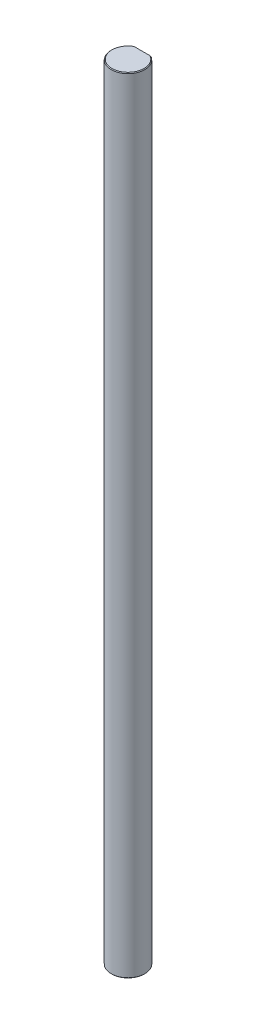
ISO-10303-21;
HEADER;
FILE_DESCRIPTION(('STEP AP214'),'2;1');
FILE_NAME('part.step','',(''),(''),'','','');
FILE_SCHEMA(('AUTOMOTIVE_DESIGN { 1 0 10303 214 1 1 1 1 }'));
ENDSEC;
DATA;
#1=APPLICATION_CONTEXT('core data for automotive mechanical design processes');
#2=APPLICATION_PROTOCOL_DEFINITION('international standard','automotive_design',2000,#1);
#3=PRODUCT_CONTEXT('',#1,'mechanical');
#4=PRODUCT('Part','Part','',(#3));
#5=PRODUCT_RELATED_PRODUCT_CATEGORY('part','',(#4));
#6=PRODUCT_DEFINITION_FORMATION('','',#4);
#7=PRODUCT_DEFINITION_CONTEXT('part definition',#1,'design');
#8=PRODUCT_DEFINITION('design','',#6,#7);
#9=PRODUCT_DEFINITION_SHAPE('','',#8);
#10=(LENGTH_UNIT() NAMED_UNIT(*) SI_UNIT(.MILLI.,.METRE.));
#11=(NAMED_UNIT(*) PLANE_ANGLE_UNIT() SI_UNIT($,.RADIAN.));
#12=(NAMED_UNIT(*) SI_UNIT($,.STERADIAN.) SOLID_ANGLE_UNIT());
#13=UNCERTAINTY_MEASURE_WITH_UNIT(LENGTH_MEASURE(1.E-05),#10,'distance_accuracy_value','');
#14=(GEOMETRIC_REPRESENTATION_CONTEXT(3) GLOBAL_UNCERTAINTY_ASSIGNED_CONTEXT((#13)) GLOBAL_UNIT_ASSIGNED_CONTEXT((#10,
#11,#12)) REPRESENTATION_CONTEXT('',''));
#15=CARTESIAN_POINT('',(0.,0.,0.));
#16=DIRECTION('',(0.,0.,1.));
#17=DIRECTION('',(1.,0.,0.));
#18=AXIS2_PLACEMENT_3D('',#15,#16,#17);
#19=CARTESIAN_POINT('',(0.,0.,0.));
#20=DIRECTION('',(0.,1.,0.));
#21=DIRECTION('',(0.,0.,1.));
#22=AXIS2_PLACEMENT_3D('',#19,#20,#21);
#23=PLANE('',#22);
#24=CARTESIAN_POINT('',(0.,5.6843418860808E-11,0.));
#25=DIRECTION('',(0.,1.,0.));
#26=DIRECTION('',(0.,0.,1.));
#27=AXIS2_PLACEMENT_3D('',#24,#25,#26);
#28=CIRCLE('',#27,2.87500000001728);
#29=CARTESIAN_POINT('',(-1.41972708646754,2.8421709430404E-11,-2.5));
#30=VERTEX_POINT('',#29);
#31=CARTESIAN_POINT('',(1.41972708646754,2.8421709430404E-11,-2.5));
#32=VERTEX_POINT('',#31);
#33=EDGE_CURVE('E19',#30,#32,#28,.T.);
#34=ORIENTED_EDGE('',*,*,#33,.F.);
#35=DIRECTION('',(-1.,0.,0.));
#36=VECTOR('',#35,1.);
#37=CARTESIAN_POINT('',(0.,0.,-2.5));
#38=LINE('',#37,#36);
#39=EDGE_CURVE('E58',#32,#30,#38,.T.);
#40=ORIENTED_EDGE('',*,*,#39,.F.);
#41=EDGE_LOOP('',(#34,#40));
#42=FACE_BOUND('',#41,.T.);
#43=ADVANCED_FACE('F16',(#42),#23,.F.);
#44=CARTESIAN_POINT('',(0.,140.,0.));
#45=DIRECTION('',(0.,1.,0.));
#46=DIRECTION('',(0.,0.,1.));
#47=AXIS2_PLACEMENT_3D('',#44,#45,#46);
#48=PLANE('',#47);
#49=DIRECTION('',(-1.,0.,0.));
#50=VECTOR('',#49,1.);
#51=CARTESIAN_POINT('',(0.,140.,-2.5));
#52=LINE('',#51,#50);
#53=CARTESIAN_POINT('',(-1.41972708647124,139.999999999993,-2.5));
#54=VERTEX_POINT('',#53);
#55=CARTESIAN_POINT('',(1.41972708647124,139.999999999993,-2.5));
#56=VERTEX_POINT('',#55);
#57=EDGE_CURVE('E66',#54,#56,#52,.F.);
#58=ORIENTED_EDGE('',*,*,#57,.F.);
#59=CARTESIAN_POINT('',(0.,139.999999999986,0.));
#60=DIRECTION('',(0.,-1.,0.));
#61=DIRECTION('',(0.,0.,-1.));
#62=AXIS2_PLACEMENT_3D('',#59,#60,#61);
#63=CIRCLE('',#62,2.87500000001728);
#64=EDGE_CURVE('E80',#56,#54,#63,.T.);
#65=ORIENTED_EDGE('',*,*,#64,.F.);
#66=EDGE_LOOP('',(#58,#65));
#67=FACE_BOUND('',#66,.T.);
#68=ADVANCED_FACE('F116',(#67),#48,.T.);
#69=CARTESIAN_POINT('',(0.,0.125000000025466,0.));
#70=DIRECTION('',(0.,1.,0.));
#71=DIRECTION('',(0.,0.,1.));
#72=AXIS2_PLACEMENT_3D('',#69,#70,#71);
#73=CONICAL_SURFACE('',#72,2.9999999999859,0.785398163397448);
#74=CARTESIAN_POINT('',(1.6583123951777,0.125000000000042,-2.5));
#75=CARTESIAN_POINT('',(1.53648159923088,0.0576554936557172,-2.5));
#76=CARTESIAN_POINT('',(1.41972708645002,0.,-2.5));
#77=B_SPLINE_CURVE_WITH_KNOTS('',2,(#74,#75,#76),.UNSPECIFIED.,.F.,.F.,(3,3),(0.,1.),.UNSPECIFIED.);
#78=CARTESIAN_POINT('',(1.6583123951777,0.125000000000042,-2.5));
#79=VERTEX_POINT('',#78);
#80=EDGE_CURVE('E60',#79,#32,#77,.T.);
#81=ORIENTED_EDGE('',*,*,#80,.F.);
#82=CARTESIAN_POINT('',(0.,0.125000000000042,0.));
#83=DIRECTION('',(0.,-1.,0.));
#84=DIRECTION('',(0.,0.,-1.));
#85=AXIS2_PLACEMENT_3D('',#82,#83,#84);
#86=CIRCLE('',#85,3.);
#87=CARTESIAN_POINT('',(-1.6583123951777,0.125000000000042,-2.5));
#88=VERTEX_POINT('',#87);
#89=EDGE_CURVE('E64',#88,#79,#86,.F.);
#90=ORIENTED_EDGE('',*,*,#89,.F.);
#91=CARTESIAN_POINT('',(-1.41972708645002,0.,-2.5));
#92=CARTESIAN_POINT('',(-1.53648159923205,0.0576554936563278,-2.5));
#93=CARTESIAN_POINT('',(-1.6583123951777,0.125000000000042,-2.5));
#94=B_SPLINE_CURVE_WITH_KNOTS('',2,(#91,#92,#93),.UNSPECIFIED.,.F.,.F.,(3,3),(0.,1.),.UNSPECIFIED.);
#95=EDGE_CURVE('E62',#30,#88,#94,.T.);
#96=ORIENTED_EDGE('',*,*,#95,.F.);
#97=ORIENTED_EDGE('',*,*,#33,.T.);
#98=EDGE_LOOP('',(#81,#90,#96,#97));
#99=FACE_BOUND('',#98,.T.);
#100=ADVANCED_FACE('F63',(#99),#73,.T.);
#101=CARTESIAN_POINT('',(0.,140.,-2.5));
#102=DIRECTION('',(0.,0.,-1.));
#103=DIRECTION('',(-1.,0.,0.));
#104=AXIS2_PLACEMENT_3D('',#101,#102,#103);
#105=PLANE('',#104);
#106=ORIENTED_EDGE('',*,*,#57,.T.);
#107=CARTESIAN_POINT('',(1.65831239513849,139.875000000075,-2.49999999994088));
#108=CARTESIAN_POINT('',(1.64826838182186,139.880552028535,-2.50000000038235));
#109=CARTESIAN_POINT('',(1.63820953600231,139.886077243711,-2.50000000116224));
#110=CARTESIAN_POINT('',(1.61812696114373,139.897036850499,-2.50000000213415));
#111=CARTESIAN_POINT('',(1.60810342662844,139.902471598582,-2.50000000232995));
#112=CARTESIAN_POINT('',(1.58809068600914,139.913250278935,-2.50000000091172));
#113=CARTESIAN_POINT('',(1.57810167339733,139.918594570408,-2.49999999930932));
#114=CARTESIAN_POINT('',(1.55815716583758,139.92919233195,-2.49999999532022));
#115=CARTESIAN_POINT('',(1.54820186314663,139.934446163804,-2.49999999293857));
#116=CARTESIAN_POINT('',(1.52832394117069,139.944863004577,-2.49999998894063));
#117=CARTESIAN_POINT('',(1.5184015127013,139.950026377577,-2.4999999873196));
#118=CARTESIAN_POINT('',(1.49858848169598,139.960262297565,-2.49999998611185));
#119=CARTESIAN_POINT('',(1.48869806831685,139.965335210655,-2.49999998651249));
#120=CARTESIAN_POINT('',(1.46894818544668,139.975390211487,-2.49999998962525));
#121=CARTESIAN_POINT('',(1.45908890323582,139.98037266702,-2.49999999232307));
#122=CARTESIAN_POINT('',(1.43940037996366,139.990246741837,-2.49999999721813));
#123=CARTESIAN_POINT('',(1.42957132405594,139.995138730335,-2.49999999941833));
#124=CARTESIAN_POINT('',(1.41972708645861,139.999999999986,-2.50000000001502));
#125=B_SPLINE_CURVE_WITH_KNOTS('',3,(#107,#108,#109,#110,#111,#112,#113,#114,#115,#116,#117,
#118,#119,#120,#121,#122,#123,#124),.UNSPECIFIED.,.F.,.F.,(4,2,2,2,2,2,2,2,4),(0.,
0.0344291032940574,0.0686352124823343,0.102621448078024,0.136391031428964,0.169947286732765,
0.203293643021228,0.236433636107549,0.269370910489108),.UNSPECIFIED.);
#126=CARTESIAN_POINT('',(1.65831239515809,139.875000000037,-2.49999999997044));
#127=VERTEX_POINT('',#126);
#128=EDGE_CURVE('E34',#127,#56,#125,.T.);
#129=ORIENTED_EDGE('',*,*,#128,.F.);
#130=DIRECTION('',(0.,-1.,0.));
#131=VECTOR('',#130,1.);
#132=CARTESIAN_POINT('',(1.6583123951777,140.,-2.5));
#133=LINE('',#132,#131);
#134=EDGE_CURVE('E25',#79,#127,#133,.F.);
#135=ORIENTED_EDGE('',*,*,#134,.F.);
#136=ORIENTED_EDGE('',*,*,#80,.T.);
#137=ORIENTED_EDGE('',*,*,#39,.T.);
#138=ORIENTED_EDGE('',*,*,#95,.T.);
#139=DIRECTION('',(0.,-1.,0.));
#140=VECTOR('',#139,1.);
#141=CARTESIAN_POINT('',(-1.6583123951777,140.,-2.5));
#142=LINE('',#141,#140);
#143=CARTESIAN_POINT('',(-1.65831239515809,139.875000000037,-2.49999999997044));
#144=VERTEX_POINT('',#143);
#145=EDGE_CURVE('E76',#144,#88,#142,.T.);
#146=ORIENTED_EDGE('',*,*,#145,.F.);
#147=CARTESIAN_POINT('',(-1.41972708645861,139.999999999986,-2.50000000001502));
#148=CARTESIAN_POINT('',(-1.42957132405592,139.995138730335,-2.49999999941834));
#149=CARTESIAN_POINT('',(-1.43940037996363,139.990246741837,-2.49999999721814));
#150=CARTESIAN_POINT('',(-1.45908890323577,139.98037266702,-2.4999999923231));
#151=CARTESIAN_POINT('',(-1.46894818544662,139.975390211487,-2.49999998962529));
#152=CARTESIAN_POINT('',(-1.48869806831678,139.965335210655,-2.49999998651253));
#153=CARTESIAN_POINT('',(-1.4985884816959,139.960262297565,-2.4999999861119));
#154=CARTESIAN_POINT('',(-1.51840151270121,139.950026377577,-2.49999998731965));
#155=CARTESIAN_POINT('',(-1.5283239411706,139.944863004577,-2.49999998894069));
#156=CARTESIAN_POINT('',(-1.54820186314654,139.934446163804,-2.49999999293863));
#157=CARTESIAN_POINT('',(-1.55815716583749,139.92919233195,-2.49999999532027));
#158=CARTESIAN_POINT('',(-1.57810167339724,139.918594570408,-2.49999999930937));
#159=CARTESIAN_POINT('',(-1.58809068600907,139.913250278935,-2.50000000091177));
#160=CARTESIAN_POINT('',(-1.60810342662838,139.902471598582,-2.50000000232999));
#161=CARTESIAN_POINT('',(-1.61812696114368,139.897036850499,-2.50000000213419));
#162=CARTESIAN_POINT('',(-1.63820953600228,139.886077243711,-2.50000000116226));
#163=CARTESIAN_POINT('',(-1.64826838182184,139.880552028535,-2.50000000038236));
#164=CARTESIAN_POINT('',(-1.65831239513849,139.875000000075,-2.49999999994088));
#165=B_SPLINE_CURVE_WITH_KNOTS('',3,(#147,#148,#149,#150,#151,#152,#153,#154,#155,#156,#157,
#158,#159,#160,#161,#162,#163,#164),.UNSPECIFIED.,.F.,.F.,(4,2,2,2,2,2,2,2,4),(0.,
0.0329372743815232,0.0660772674678189,0.0994236237562664,0.132979879060063,0.166749462411007,
0.200735698006711,0.234941807195015,0.269370910489108),.UNSPECIFIED.);
#166=EDGE_CURVE('E84',#54,#144,#165,.T.);
#167=ORIENTED_EDGE('',*,*,#166,.F.);
#168=EDGE_LOOP('',(#106,#129,#135,#136,#137,#138,#146,#167));
#169=FACE_BOUND('',#168,.T.);
#170=ADVANCED_FACE('F68',(#169),#105,.T.);
#171=CARTESIAN_POINT('',(0.,139.875000000131,0.));
#172=DIRECTION('',(0.,-1.,0.));
#173=DIRECTION('',(0.,0.,-1.));
#174=AXIS2_PLACEMENT_3D('',#171,#172,#173);
#175=CONICAL_SURFACE('',#174,2.99999999987222,0.785398163397448);
#176=ORIENTED_EDGE('',*,*,#128,.T.);
#177=ORIENTED_EDGE('',*,*,#64,.T.);
#178=ORIENTED_EDGE('',*,*,#166,.T.);
#179=CARTESIAN_POINT('',(0.,139.875,0.));
#180=DIRECTION('',(0.,-1.,0.));
#181=DIRECTION('',(0.,0.,-1.));
#182=AXIS2_PLACEMENT_3D('',#179,#180,#181);
#183=CIRCLE('',#182,3.);
#184=EDGE_CURVE('E9',#127,#144,#183,.T.);
#185=ORIENTED_EDGE('',*,*,#184,.F.);
#186=EDGE_LOOP('',(#176,#177,#178,#185));
#187=FACE_BOUND('',#186,.T.);
#188=ADVANCED_FACE('F86',(#187),#175,.T.);
#189=CARTESIAN_POINT('',(0.,140.,0.));
#190=DIRECTION('',(0.,-1.,0.));
#191=DIRECTION('',(0.,0.,-1.));
#192=AXIS2_PLACEMENT_3D('',#189,#190,#191);
#193=CYLINDRICAL_SURFACE('',#192,3.);
#194=ORIENTED_EDGE('',*,*,#134,.T.);
#195=ORIENTED_EDGE('',*,*,#184,.T.);
#196=ORIENTED_EDGE('',*,*,#145,.T.);
#197=ORIENTED_EDGE('',*,*,#89,.T.);
#198=EDGE_LOOP('',(#194,#195,#196,#197));
#199=FACE_BOUND('',#198,.T.);
#200=ADVANCED_FACE('F96',(#199),#193,.T.);
#201=CLOSED_SHELL('',(#43,#68,#100,#170,#188,#200));
#202=MANIFOLD_SOLID_BREP('B1',#201);
#203=ADVANCED_BREP_SHAPE_REPRESENTATION('',(#18,#202),#14);
#204=SHAPE_DEFINITION_REPRESENTATION(#9,#203);
ENDSEC;
END-ISO-10303-21;
